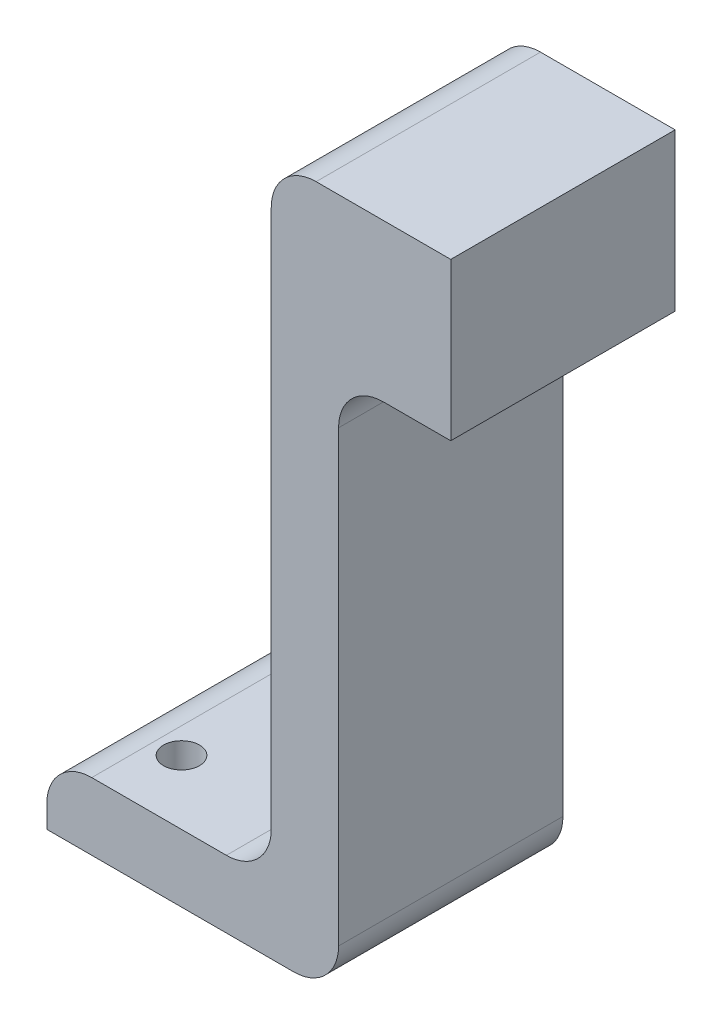
ISO-10303-21;
HEADER;
FILE_DESCRIPTION(('STEP AP214'),'2;1');
FILE_NAME('part.step','',(''),(''),'','','');
FILE_SCHEMA(('AUTOMOTIVE_DESIGN { 1 0 10303 214 1 1 1 1 }'));
ENDSEC;
DATA;
#1=APPLICATION_CONTEXT('core data for automotive mechanical design processes');
#2=APPLICATION_PROTOCOL_DEFINITION('international standard','automotive_design',2000,#1);
#3=PRODUCT_CONTEXT('',#1,'mechanical');
#4=PRODUCT('Part','Part','',(#3));
#5=PRODUCT_RELATED_PRODUCT_CATEGORY('part','',(#4));
#6=PRODUCT_DEFINITION_FORMATION('','',#4);
#7=PRODUCT_DEFINITION_CONTEXT('part definition',#1,'design');
#8=PRODUCT_DEFINITION('design','',#6,#7);
#9=PRODUCT_DEFINITION_SHAPE('','',#8);
#10=(LENGTH_UNIT() NAMED_UNIT(*) SI_UNIT(.MILLI.,.METRE.));
#11=(NAMED_UNIT(*) PLANE_ANGLE_UNIT() SI_UNIT($,.RADIAN.));
#12=(NAMED_UNIT(*) SI_UNIT($,.STERADIAN.) SOLID_ANGLE_UNIT());
#13=UNCERTAINTY_MEASURE_WITH_UNIT(LENGTH_MEASURE(1.E-05),#10,'distance_accuracy_value','');
#14=(GEOMETRIC_REPRESENTATION_CONTEXT(3) GLOBAL_UNCERTAINTY_ASSIGNED_CONTEXT((#13)) GLOBAL_UNIT_ASSIGNED_CONTEXT((#10,
#11,#12)) REPRESENTATION_CONTEXT('',''));
#15=CARTESIAN_POINT('',(0.,0.,0.));
#16=DIRECTION('',(0.,0.,1.));
#17=DIRECTION('',(1.,0.,0.));
#18=AXIS2_PLACEMENT_3D('',#15,#16,#17);
#19=CARTESIAN_POINT('',(0.,2.,-0.625));
#20=DIRECTION('',(0.,-1.,0.));
#21=DIRECTION('',(0.,0.,-1.));
#22=AXIS2_PLACEMENT_3D('',#19,#20,#21);
#23=PLANE('',#22);
#24=DIRECTION('',(1.,0.,0.));
#25=VECTOR('',#24,1.);
#26=CARTESIAN_POINT('',(0.,2.,-0.625));
#27=LINE('',#26,#25);
#28=CARTESIAN_POINT('',(0.0357694352722879,2.,-0.625));
#29=VERTEX_POINT('',#28);
#30=CARTESIAN_POINT('',(1.53576943527229,2.,-0.625));
#31=VERTEX_POINT('',#30);
#32=EDGE_CURVE('E223',#29,#31,#27,.T.);
#33=ORIENTED_EDGE('',*,*,#32,.F.);
#34=DIRECTION('',(0.,0.,1.));
#35=VECTOR('',#34,1.);
#36=CARTESIAN_POINT('',(0.0357694352722879,2.,-0.625));
#37=LINE('',#36,#35);
#38=CARTESIAN_POINT('',(0.0357694352722879,2.,1.875));
#39=VERTEX_POINT('',#38);
#40=EDGE_CURVE('E282',#29,#39,#37,.T.);
#41=ORIENTED_EDGE('',*,*,#40,.T.);
#42=DIRECTION('',(1.,0.,0.));
#43=VECTOR('',#42,1.);
#44=CARTESIAN_POINT('',(0.,2.,1.875));
#45=LINE('',#44,#43);
#46=CARTESIAN_POINT('',(1.53576943527229,2.,1.875));
#47=VERTEX_POINT('',#46);
#48=EDGE_CURVE('E213',#39,#47,#45,.T.);
#49=ORIENTED_EDGE('',*,*,#48,.T.);
#50=DIRECTION('',(0.,0.,1.));
#51=VECTOR('',#50,1.);
#52=CARTESIAN_POINT('',(1.53576943527229,2.,-0.625));
#53=LINE('',#52,#51);
#54=EDGE_CURVE('E207',#31,#47,#53,.T.);
#55=ORIENTED_EDGE('',*,*,#54,.F.);
#56=EDGE_LOOP('',(#33,#41,#49,#55));
#57=FACE_BOUND('',#56,.T.);
#58=ADVANCED_FACE('F89',(#57),#23,.F.);
#59=CARTESIAN_POINT('',(-0.464230564727712,0.,-0.625));
#60=DIRECTION('',(1.,0.,0.));
#61=DIRECTION('',(0.,1.,0.));
#62=AXIS2_PLACEMENT_3D('',#59,#60,#61);
#63=PLANE('',#62);
#64=DIRECTION('',(0.,1.,0.));
#65=VECTOR('',#64,1.);
#66=CARTESIAN_POINT('',(-0.464230564727712,0.,-0.625));
#67=LINE('',#66,#65);
#68=CARTESIAN_POINT('',(-0.464230564727711,-4.5,-0.625));
#69=VERTEX_POINT('',#68);
#70=CARTESIAN_POINT('',(-0.464230564727712,1.5,-0.625));
#71=VERTEX_POINT('',#70);
#72=EDGE_CURVE('E208',#69,#71,#67,.T.);
#73=ORIENTED_EDGE('',*,*,#72,.F.);
#74=DIRECTION('',(0.,0.,1.));
#75=VECTOR('',#74,1.);
#76=CARTESIAN_POINT('',(-0.464230564727711,-4.5,-0.625));
#77=LINE('',#76,#75);
#78=CARTESIAN_POINT('',(-0.464230564727711,-4.5,1.875));
#79=VERTEX_POINT('',#78);
#80=EDGE_CURVE('E277',#69,#79,#77,.T.);
#81=ORIENTED_EDGE('',*,*,#80,.T.);
#82=DIRECTION('',(0.,1.,0.));
#83=VECTOR('',#82,1.);
#84=CARTESIAN_POINT('',(-0.464230564727712,0.,1.875));
#85=LINE('',#84,#83);
#86=CARTESIAN_POINT('',(-0.464230564727712,1.5,1.875));
#87=VERTEX_POINT('',#86);
#88=EDGE_CURVE('E215',#79,#87,#85,.T.);
#89=ORIENTED_EDGE('',*,*,#88,.T.);
#90=DIRECTION('',(0.,0.,1.));
#91=VECTOR('',#90,1.);
#92=CARTESIAN_POINT('',(-0.464230564727712,1.5,-0.625));
#93=LINE('',#92,#91);
#94=EDGE_CURVE('E112',#87,#71,#93,.F.);
#95=ORIENTED_EDGE('',*,*,#94,.T.);
#96=EDGE_LOOP('',(#73,#81,#89,#95));
#97=FACE_BOUND('',#96,.T.);
#98=ADVANCED_FACE('F308',(#97),#63,.F.);
#99=CARTESIAN_POINT('',(1.53576943527229,0.,-0.625));
#100=DIRECTION('',(1.,0.,0.));
#101=DIRECTION('',(0.,0.,-1.));
#102=AXIS2_PLACEMENT_3D('',#99,#100,#101);
#103=PLANE('',#102);
#104=ORIENTED_EDGE('',*,*,#54,.T.);
#105=DIRECTION('',(0.,1.,0.));
#106=VECTOR('',#105,1.);
#107=CARTESIAN_POINT('',(1.53576943527229,0.,1.875));
#108=LINE('',#107,#106);
#109=CARTESIAN_POINT('',(1.53576943527229,0.25,1.875));
#110=VERTEX_POINT('',#109);
#111=EDGE_CURVE('E191',#110,#47,#108,.T.);
#112=ORIENTED_EDGE('',*,*,#111,.F.);
#113=DIRECTION('',(0.,0.,1.));
#114=VECTOR('',#113,1.);
#115=CARTESIAN_POINT('',(1.53576943527229,0.25,-0.625));
#116=LINE('',#115,#114);
#117=CARTESIAN_POINT('',(1.53576943527229,0.25,-0.625));
#118=VERTEX_POINT('',#117);
#119=EDGE_CURVE('E200',#118,#110,#116,.T.);
#120=ORIENTED_EDGE('',*,*,#119,.F.);
#121=DIRECTION('',(0.,1.,0.));
#122=VECTOR('',#121,1.);
#123=CARTESIAN_POINT('',(1.53576943527229,0.,-0.625));
#124=LINE('',#123,#122);
#125=EDGE_CURVE('E221',#118,#31,#124,.T.);
#126=ORIENTED_EDGE('',*,*,#125,.T.);
#127=EDGE_LOOP('',(#104,#112,#120,#126));
#128=FACE_BOUND('',#127,.T.);
#129=ADVANCED_FACE('F211',(#128),#103,.T.);
#130=CARTESIAN_POINT('',(0.,0.,-0.625));
#131=DIRECTION('',(0.,0.,1.));
#132=DIRECTION('',(1.,0.,0.));
#133=AXIS2_PLACEMENT_3D('',#130,#131,#132);
#134=PLANE('',#133);
#135=DIRECTION('',(0.,1.,0.));
#136=VECTOR('',#135,1.);
#137=CARTESIAN_POINT('',(-2.96423056472771,0.,-0.625));
#138=LINE('',#137,#136);
#139=CARTESIAN_POINT('',(-2.96423056472771,-5.75,-0.625));
#140=VERTEX_POINT('',#139);
#141=CARTESIAN_POINT('',(-2.96423056472771,-5.5,-0.625));
#142=VERTEX_POINT('',#141);
#143=EDGE_CURVE('E242',#140,#142,#138,.T.);
#144=ORIENTED_EDGE('',*,*,#143,.T.);
#145=CARTESIAN_POINT('',(-2.46423056472771,-5.5,-0.625));
#146=DIRECTION('',(0.,0.,1.));
#147=DIRECTION('',(1.,0.,0.));
#148=AXIS2_PLACEMENT_3D('',#145,#146,#147);
#149=CIRCLE('',#148,0.5);
#150=CARTESIAN_POINT('',(-2.46423056472771,-5.,-0.625));
#151=VERTEX_POINT('',#150);
#152=EDGE_CURVE('E267',#142,#151,#149,.F.);
#153=ORIENTED_EDGE('',*,*,#152,.T.);
#154=DIRECTION('',(-1.,0.,0.));
#155=VECTOR('',#154,1.);
#156=CARTESIAN_POINT('',(0.,-5.,-0.625));
#157=LINE('',#156,#155);
#158=CARTESIAN_POINT('',(-0.964230564727712,-5.,-0.625));
#159=VERTEX_POINT('',#158);
#160=EDGE_CURVE('E247',#159,#151,#157,.T.);
#161=ORIENTED_EDGE('',*,*,#160,.F.);
#162=CARTESIAN_POINT('',(-0.964230564727712,-4.5,-0.625));
#163=DIRECTION('',(0.,0.,1.));
#164=DIRECTION('',(1.,0.,0.));
#165=AXIS2_PLACEMENT_3D('',#162,#163,#164);
#166=CIRCLE('',#165,0.5);
#167=EDGE_CURVE('E287',#159,#69,#166,.T.);
#168=ORIENTED_EDGE('',*,*,#167,.T.);
#169=ORIENTED_EDGE('',*,*,#72,.T.);
#170=CARTESIAN_POINT('',(0.0357694352722879,1.5,-0.625));
#171=DIRECTION('',(0.,0.,1.));
#172=DIRECTION('',(1.,0.,0.));
#173=AXIS2_PLACEMENT_3D('',#170,#171,#172);
#174=CIRCLE('',#173,0.5);
#175=EDGE_CURVE('E104',#71,#29,#174,.F.);
#176=ORIENTED_EDGE('',*,*,#175,.T.);
#177=ORIENTED_EDGE('',*,*,#32,.T.);
#178=ORIENTED_EDGE('',*,*,#125,.F.);
#179=DIRECTION('',(1.,0.,0.));
#180=VECTOR('',#179,1.);
#181=CARTESIAN_POINT('',(0.,0.25,-0.625));
#182=LINE('',#181,#180);
#183=CARTESIAN_POINT('',(0.785769435272288,0.25,-0.625));
#184=VERTEX_POINT('',#183);
#185=EDGE_CURVE('E203',#184,#118,#182,.T.);
#186=ORIENTED_EDGE('',*,*,#185,.F.);
#187=CARTESIAN_POINT('',(0.785769435272288,-0.25,-0.625));
#188=DIRECTION('',(0.,0.,1.));
#189=DIRECTION('',(1.,0.,0.));
#190=AXIS2_PLACEMENT_3D('',#187,#188,#189);
#191=CIRCLE('',#190,0.5);
#192=CARTESIAN_POINT('',(0.285769435272288,-0.25,-0.625));
#193=VERTEX_POINT('',#192);
#194=EDGE_CURVE('E97',#184,#193,#191,.T.);
#195=ORIENTED_EDGE('',*,*,#194,.T.);
#196=DIRECTION('',(0.,-1.,0.));
#197=VECTOR('',#196,1.);
#198=CARTESIAN_POINT('',(0.285769435272288,0.25,-0.625));
#199=LINE('',#198,#197);
#200=CARTESIAN_POINT('',(0.285769435272291,-5.25,-0.625));
#201=VERTEX_POINT('',#200);
#202=EDGE_CURVE('E228',#193,#201,#199,.T.);
#203=ORIENTED_EDGE('',*,*,#202,.T.);
#204=CARTESIAN_POINT('',(-0.214230564727709,-5.25,-0.625));
#205=DIRECTION('',(0.,0.,1.));
#206=DIRECTION('',(1.,0.,0.));
#207=AXIS2_PLACEMENT_3D('',#204,#205,#206);
#208=CIRCLE('',#207,0.5);
#209=CARTESIAN_POINT('',(-0.214230564727709,-5.75,-0.625));
#210=VERTEX_POINT('',#209);
#211=EDGE_CURVE('E265',#201,#210,#208,.F.);
#212=ORIENTED_EDGE('',*,*,#211,.T.);
#213=DIRECTION('',(-1.,0.,0.));
#214=VECTOR('',#213,1.);
#215=CARTESIAN_POINT('',(0.,-5.75,-0.625));
#216=LINE('',#215,#214);
#217=EDGE_CURVE('E245',#210,#140,#216,.T.);
#218=ORIENTED_EDGE('',*,*,#217,.T.);
#219=EDGE_LOOP('',(#144,#153,#161,#168,#169,#176,#177,#178,#186,#195,#203,#212,#218));
#220=FACE_BOUND('',#219,.T.);
#221=ADVANCED_FACE('F289',(#220),#134,.F.);
#222=CARTESIAN_POINT('',(0.,0.,1.875));
#223=DIRECTION('',(0.,0.,1.));
#224=DIRECTION('',(1.,0.,0.));
#225=AXIS2_PLACEMENT_3D('',#222,#223,#224);
#226=PLANE('',#225);
#227=DIRECTION('',(-1.,0.,0.));
#228=VECTOR('',#227,1.);
#229=CARTESIAN_POINT('',(0.,-5.,1.875));
#230=LINE('',#229,#228);
#231=CARTESIAN_POINT('',(-0.964230564727712,-5.,1.875));
#232=VERTEX_POINT('',#231);
#233=CARTESIAN_POINT('',(-2.46423056472771,-5.,1.875));
#234=VERTEX_POINT('',#233);
#235=EDGE_CURVE('E240',#232,#234,#230,.T.);
#236=ORIENTED_EDGE('',*,*,#235,.T.);
#237=CARTESIAN_POINT('',(-2.46423056472771,-5.5,1.875));
#238=DIRECTION('',(0.,0.,1.));
#239=DIRECTION('',(1.,0.,0.));
#240=AXIS2_PLACEMENT_3D('',#237,#238,#239);
#241=CIRCLE('',#240,0.5);
#242=CARTESIAN_POINT('',(-2.96423056472771,-5.5,1.875));
#243=VERTEX_POINT('',#242);
#244=EDGE_CURVE('E260',#234,#243,#241,.T.);
#245=ORIENTED_EDGE('',*,*,#244,.T.);
#246=DIRECTION('',(0.,1.,0.));
#247=VECTOR('',#246,1.);
#248=CARTESIAN_POINT('',(-2.96423056472771,0.,1.875));
#249=LINE('',#248,#247);
#250=CARTESIAN_POINT('',(-2.96423056472771,-5.75,1.875));
#251=VERTEX_POINT('',#250);
#252=EDGE_CURVE('E235',#251,#243,#249,.T.);
#253=ORIENTED_EDGE('',*,*,#252,.F.);
#254=DIRECTION('',(-1.,0.,0.));
#255=VECTOR('',#254,1.);
#256=CARTESIAN_POINT('',(0.,-5.75,1.875));
#257=LINE('',#256,#255);
#258=CARTESIAN_POINT('',(-0.214230564727709,-5.75,1.875));
#259=VERTEX_POINT('',#258);
#260=EDGE_CURVE('E238',#259,#251,#257,.T.);
#261=ORIENTED_EDGE('',*,*,#260,.F.);
#262=CARTESIAN_POINT('',(-0.214230564727709,-5.25,1.875));
#263=DIRECTION('',(0.,0.,1.));
#264=DIRECTION('',(1.,0.,0.));
#265=AXIS2_PLACEMENT_3D('',#262,#263,#264);
#266=CIRCLE('',#265,0.5);
#267=CARTESIAN_POINT('',(0.285769435272291,-5.25,1.875));
#268=VERTEX_POINT('',#267);
#269=EDGE_CURVE('E258',#259,#268,#266,.T.);
#270=ORIENTED_EDGE('',*,*,#269,.T.);
#271=DIRECTION('',(0.,-1.,0.));
#272=VECTOR('',#271,1.);
#273=CARTESIAN_POINT('',(0.285769435272288,0.25,1.875));
#274=LINE('',#273,#272);
#275=CARTESIAN_POINT('',(0.285769435272288,-0.25,1.875));
#276=VERTEX_POINT('',#275);
#277=EDGE_CURVE('E231',#276,#268,#274,.T.);
#278=ORIENTED_EDGE('',*,*,#277,.F.);
#279=CARTESIAN_POINT('',(0.785769435272288,-0.25,1.875));
#280=DIRECTION('',(0.,0.,1.));
#281=DIRECTION('',(1.,0.,0.));
#282=AXIS2_PLACEMENT_3D('',#279,#280,#281);
#283=CIRCLE('',#282,0.5);
#284=CARTESIAN_POINT('',(0.785769435272288,0.25,1.875));
#285=VERTEX_POINT('',#284);
#286=EDGE_CURVE('E12',#276,#285,#283,.F.);
#287=ORIENTED_EDGE('',*,*,#286,.T.);
#288=DIRECTION('',(1.,0.,0.));
#289=VECTOR('',#288,1.);
#290=CARTESIAN_POINT('',(0.,0.25,1.875));
#291=LINE('',#290,#289);
#292=EDGE_CURVE('E185',#285,#110,#291,.T.);
#293=ORIENTED_EDGE('',*,*,#292,.T.);
#294=ORIENTED_EDGE('',*,*,#111,.T.);
#295=ORIENTED_EDGE('',*,*,#48,.F.);
#296=CARTESIAN_POINT('',(0.0357694352722879,1.5,1.875));
#297=DIRECTION('',(0.,0.,1.));
#298=DIRECTION('',(1.,0.,0.));
#299=AXIS2_PLACEMENT_3D('',#296,#297,#298);
#300=CIRCLE('',#299,0.5);
#301=EDGE_CURVE('E256',#39,#87,#300,.T.);
#302=ORIENTED_EDGE('',*,*,#301,.T.);
#303=ORIENTED_EDGE('',*,*,#88,.F.);
#304=CARTESIAN_POINT('',(-0.964230564727712,-4.5,1.875));
#305=DIRECTION('',(0.,0.,1.));
#306=DIRECTION('',(1.,0.,0.));
#307=AXIS2_PLACEMENT_3D('',#304,#305,#306);
#308=CIRCLE('',#307,0.5);
#309=EDGE_CURVE('E285',#79,#232,#308,.F.);
#310=ORIENTED_EDGE('',*,*,#309,.T.);
#311=EDGE_LOOP('',(#236,#245,#253,#261,#270,#278,#287,#293,#294,#295,#302,#303,#310));
#312=FACE_BOUND('',#311,.T.);
#313=ADVANCED_FACE('F188',(#312),#226,.T.);
#314=CARTESIAN_POINT('',(0.,0.25,-0.625));
#315=DIRECTION('',(0.,-1.,0.));
#316=DIRECTION('',(0.,0.,-1.));
#317=AXIS2_PLACEMENT_3D('',#314,#315,#316);
#318=PLANE('',#317);
#319=ORIENTED_EDGE('',*,*,#292,.F.);
#320=DIRECTION('',(0.,0.,-1.));
#321=VECTOR('',#320,1.);
#322=CARTESIAN_POINT('',(0.785769435272288,0.25,-0.625));
#323=LINE('',#322,#321);
#324=EDGE_CURVE('E280',#285,#184,#323,.T.);
#325=ORIENTED_EDGE('',*,*,#324,.T.);
#326=ORIENTED_EDGE('',*,*,#185,.T.);
#327=ORIENTED_EDGE('',*,*,#119,.T.);
#328=EDGE_LOOP('',(#319,#325,#326,#327));
#329=FACE_BOUND('',#328,.T.);
#330=ADVANCED_FACE('F201',(#329),#318,.T.);
#331=CARTESIAN_POINT('',(0.,-5.,-0.625));
#332=DIRECTION('',(0.,1.,0.));
#333=DIRECTION('',(0.,0.,1.));
#334=AXIS2_PLACEMENT_3D('',#331,#332,#333);
#335=PLANE('',#334);
#336=CARTESIAN_POINT('',(-1.71423056472771,-5.,0.));
#337=DIRECTION('',(0.,1.,0.));
#338=DIRECTION('',(0.,0.,1.));
#339=AXIS2_PLACEMENT_3D('',#336,#337,#338);
#340=CIRCLE('',#339,0.2);
#341=CARTESIAN_POINT('',(-1.71423056472771,-5.,0.2));
#342=VERTEX_POINT('',#341);
#343=EDGE_CURVE('E483',#342,#342,#340,.T.);
#344=ORIENTED_EDGE('',*,*,#343,.F.);
#345=EDGE_LOOP('',(#344));
#346=FACE_BOUND('',#345,.T.);
#347=CARTESIAN_POINT('',(-2.17846891017034,-5.,1.16059586360657));
#348=DIRECTION('',(0.,1.,0.));
#349=DIRECTION('',(0.,0.,1.));
#350=AXIS2_PLACEMENT_3D('',#347,#348,#349);
#351=CIRCLE('',#350,0.2);
#352=CARTESIAN_POINT('',(-2.17846891017034,-5.,1.36059586360657));
#353=VERTEX_POINT('',#352);
#354=EDGE_CURVE('E485',#353,#353,#351,.T.);
#355=ORIENTED_EDGE('',*,*,#354,.F.);
#356=EDGE_LOOP('',(#355));
#357=FACE_BOUND('',#356,.T.);
#358=ORIENTED_EDGE('',*,*,#160,.T.);
#359=DIRECTION('',(0.,0.,1.));
#360=VECTOR('',#359,1.);
#361=CARTESIAN_POINT('',(-2.46423056472771,-5.,1.875));
#362=LINE('',#361,#360);
#363=EDGE_CURVE('E253',#151,#234,#362,.T.);
#364=ORIENTED_EDGE('',*,*,#363,.T.);
#365=ORIENTED_EDGE('',*,*,#235,.F.);
#366=DIRECTION('',(0.,0.,1.));
#367=VECTOR('',#366,1.);
#368=CARTESIAN_POINT('',(-0.964230564727712,-5.,-0.625));
#369=LINE('',#368,#367);
#370=EDGE_CURVE('E226',#232,#159,#369,.F.);
#371=ORIENTED_EDGE('',*,*,#370,.T.);
#372=EDGE_LOOP('',(#358,#364,#365,#371));
#373=FACE_BOUND('',#372,.T.);
#374=ADVANCED_FACE('F321',(#346,#357,#373),#335,.T.);
#375=CARTESIAN_POINT('',(-2.96423056472771,0.,-0.625));
#376=DIRECTION('',(1.,0.,0.));
#377=DIRECTION('',(0.,0.,-1.));
#378=AXIS2_PLACEMENT_3D('',#375,#376,#377);
#379=PLANE('',#378);
#380=ORIENTED_EDGE('',*,*,#252,.T.);
#381=DIRECTION('',(0.,0.,1.));
#382=VECTOR('',#381,1.);
#383=CARTESIAN_POINT('',(-2.96423056472771,-5.5,-0.625));
#384=LINE('',#383,#382);
#385=EDGE_CURVE('E262',#243,#142,#384,.F.);
#386=ORIENTED_EDGE('',*,*,#385,.T.);
#387=ORIENTED_EDGE('',*,*,#143,.F.);
#388=DIRECTION('',(0.,0.,1.));
#389=VECTOR('',#388,1.);
#390=CARTESIAN_POINT('',(-2.96423056472771,-5.75,-0.625));
#391=LINE('',#390,#389);
#392=EDGE_CURVE('E197',#140,#251,#391,.T.);
#393=ORIENTED_EDGE('',*,*,#392,.T.);
#394=EDGE_LOOP('',(#380,#386,#387,#393));
#395=FACE_BOUND('',#394,.T.);
#396=ADVANCED_FACE('F326',(#395),#379,.F.);
#397=CARTESIAN_POINT('',(0.,-5.75,-0.625));
#398=DIRECTION('',(0.,1.,0.));
#399=DIRECTION('',(0.,0.,1.));
#400=AXIS2_PLACEMENT_3D('',#397,#398,#399);
#401=PLANE('',#400);
#402=CARTESIAN_POINT('',(-1.71423056472771,-5.75,0.));
#403=DIRECTION('',(0.,1.,0.));
#404=DIRECTION('',(0.,0.,1.));
#405=AXIS2_PLACEMENT_3D('',#402,#403,#404);
#406=CIRCLE('',#405,0.2);
#407=CARTESIAN_POINT('',(-1.71423056472771,-5.75,0.2));
#408=VERTEX_POINT('',#407);
#409=EDGE_CURVE('E480',#408,#408,#406,.T.);
#410=ORIENTED_EDGE('',*,*,#409,.T.);
#411=EDGE_LOOP('',(#410));
#412=FACE_BOUND('',#411,.T.);
#413=CARTESIAN_POINT('',(-2.17846891017034,-5.75,1.16059586360657));
#414=DIRECTION('',(0.,1.,0.));
#415=DIRECTION('',(0.,0.,1.));
#416=AXIS2_PLACEMENT_3D('',#413,#414,#415);
#417=CIRCLE('',#416,0.2);
#418=CARTESIAN_POINT('',(-2.17846891017034,-5.75,1.36059586360657));
#419=VERTEX_POINT('',#418);
#420=EDGE_CURVE('E232',#419,#419,#417,.T.);
#421=ORIENTED_EDGE('',*,*,#420,.T.);
#422=EDGE_LOOP('',(#421));
#423=FACE_BOUND('',#422,.T.);
#424=ORIENTED_EDGE('',*,*,#217,.F.);
#425=DIRECTION('',(0.,0.,-1.));
#426=VECTOR('',#425,1.);
#427=CARTESIAN_POINT('',(-0.214230564727709,-5.75,1.875));
#428=LINE('',#427,#426);
#429=EDGE_CURVE('E274',#210,#259,#428,.F.);
#430=ORIENTED_EDGE('',*,*,#429,.T.);
#431=ORIENTED_EDGE('',*,*,#260,.T.);
#432=ORIENTED_EDGE('',*,*,#392,.F.);
#433=EDGE_LOOP('',(#424,#430,#431,#432));
#434=FACE_BOUND('',#433,.T.);
#435=ADVANCED_FACE('F325',(#412,#423,#434),#401,.F.);
#436=CARTESIAN_POINT('',(0.285769435272288,0.25,1.875));
#437=DIRECTION('',(1.,0.,0.));
#438=DIRECTION('',(0.,1.,0.));
#439=AXIS2_PLACEMENT_3D('',#436,#437,#438);
#440=PLANE('',#439);
#441=ORIENTED_EDGE('',*,*,#277,.T.);
#442=DIRECTION('',(0.,0.,-1.));
#443=VECTOR('',#442,1.);
#444=CARTESIAN_POINT('',(0.285769435272291,-5.25,-0.625));
#445=LINE('',#444,#443);
#446=EDGE_CURVE('E271',#268,#201,#445,.T.);
#447=ORIENTED_EDGE('',*,*,#446,.T.);
#448=ORIENTED_EDGE('',*,*,#202,.F.);
#449=DIRECTION('',(0.,0.,-1.));
#450=VECTOR('',#449,1.);
#451=CARTESIAN_POINT('',(0.285769435272288,-0.25,1.875));
#452=LINE('',#451,#450);
#453=EDGE_CURVE('E269',#193,#276,#452,.F.);
#454=ORIENTED_EDGE('',*,*,#453,.T.);
#455=EDGE_LOOP('',(#441,#447,#448,#454));
#456=FACE_BOUND('',#455,.T.);
#457=ADVANCED_FACE('F293',(#456),#440,.T.);
#458=CARTESIAN_POINT('',(-2.46423056472771,-5.5,-0.625));
#459=DIRECTION('',(0.,0.,-1.));
#460=DIRECTION('',(-1.,0.,0.));
#461=AXIS2_PLACEMENT_3D('',#458,#459,#460);
#462=CYLINDRICAL_SURFACE('',#461,0.5);
#463=ORIENTED_EDGE('',*,*,#152,.F.);
#464=ORIENTED_EDGE('',*,*,#385,.F.);
#465=ORIENTED_EDGE('',*,*,#244,.F.);
#466=ORIENTED_EDGE('',*,*,#363,.F.);
#467=EDGE_LOOP('',(#463,#464,#465,#466));
#468=FACE_BOUND('',#467,.T.);
#469=ADVANCED_FACE('F324',(#468),#462,.T.);
#470=CARTESIAN_POINT('',(-0.214230564727709,-5.25,1.875));
#471=DIRECTION('',(0.,0.,1.));
#472=DIRECTION('',(1.,0.,0.));
#473=AXIS2_PLACEMENT_3D('',#470,#471,#472);
#474=CYLINDRICAL_SURFACE('',#473,0.5);
#475=ORIENTED_EDGE('',*,*,#269,.F.);
#476=ORIENTED_EDGE('',*,*,#429,.F.);
#477=ORIENTED_EDGE('',*,*,#211,.F.);
#478=ORIENTED_EDGE('',*,*,#446,.F.);
#479=EDGE_LOOP('',(#475,#476,#477,#478));
#480=FACE_BOUND('',#479,.T.);
#481=ADVANCED_FACE('F304',(#480),#474,.T.);
#482=CARTESIAN_POINT('',(-0.964230564727712,-4.5,-0.625));
#483=DIRECTION('',(0.,0.,1.));
#484=DIRECTION('',(1.,0.,0.));
#485=AXIS2_PLACEMENT_3D('',#482,#483,#484);
#486=CYLINDRICAL_SURFACE('',#485,0.5);
#487=ORIENTED_EDGE('',*,*,#167,.F.);
#488=ORIENTED_EDGE('',*,*,#370,.F.);
#489=ORIENTED_EDGE('',*,*,#309,.F.);
#490=ORIENTED_EDGE('',*,*,#80,.F.);
#491=EDGE_LOOP('',(#487,#488,#489,#490));
#492=FACE_BOUND('',#491,.T.);
#493=ADVANCED_FACE('F297',(#492),#486,.F.);
#494=CARTESIAN_POINT('',(0.785769435272288,-0.25,-0.625));
#495=DIRECTION('',(0.,0.,1.));
#496=DIRECTION('',(1.,0.,0.));
#497=AXIS2_PLACEMENT_3D('',#494,#495,#496);
#498=CYLINDRICAL_SURFACE('',#497,0.5);
#499=ORIENTED_EDGE('',*,*,#286,.F.);
#500=ORIENTED_EDGE('',*,*,#453,.F.);
#501=ORIENTED_EDGE('',*,*,#194,.F.);
#502=ORIENTED_EDGE('',*,*,#324,.F.);
#503=EDGE_LOOP('',(#499,#500,#501,#502));
#504=FACE_BOUND('',#503,.T.);
#505=ADVANCED_FACE('F295',(#504),#498,.F.);
#506=CARTESIAN_POINT('',(0.0357694352722879,1.5,-0.625));
#507=DIRECTION('',(0.,0.,1.));
#508=DIRECTION('',(1.,0.,0.));
#509=AXIS2_PLACEMENT_3D('',#506,#507,#508);
#510=CYLINDRICAL_SURFACE('',#509,0.5);
#511=ORIENTED_EDGE('',*,*,#175,.F.);
#512=ORIENTED_EDGE('',*,*,#94,.F.);
#513=ORIENTED_EDGE('',*,*,#301,.F.);
#514=ORIENTED_EDGE('',*,*,#40,.F.);
#515=EDGE_LOOP('',(#511,#512,#513,#514));
#516=FACE_BOUND('',#515,.T.);
#517=ADVANCED_FACE('F91',(#516),#510,.T.);
#518=CARTESIAN_POINT('',(-2.17846891017034,-5.,1.16059586360657));
#519=DIRECTION('',(0.,1.,0.));
#520=DIRECTION('',(0.,0.,1.));
#521=AXIS2_PLACEMENT_3D('',#518,#519,#520);
#522=CYLINDRICAL_SURFACE('',#521,0.2);
#523=ORIENTED_EDGE('',*,*,#420,.F.);
#524=EDGE_LOOP('',(#523));
#525=FACE_BOUND('',#524,.T.);
#526=ORIENTED_EDGE('',*,*,#354,.T.);
#527=EDGE_LOOP('',(#526));
#528=FACE_BOUND('',#527,.T.);
#529=ADVANCED_FACE('F302',(#525,#528),#522,.F.);
#530=CARTESIAN_POINT('',(-1.71423056472771,-5.,0.));
#531=DIRECTION('',(0.,1.,0.));
#532=DIRECTION('',(0.,0.,1.));
#533=AXIS2_PLACEMENT_3D('',#530,#531,#532);
#534=CYLINDRICAL_SURFACE('',#533,0.2);
#535=ORIENTED_EDGE('',*,*,#409,.F.);
#536=EDGE_LOOP('',(#535));
#537=FACE_BOUND('',#536,.T.);
#538=ORIENTED_EDGE('',*,*,#343,.T.);
#539=EDGE_LOOP('',(#538));
#540=FACE_BOUND('',#539,.T.);
#541=ADVANCED_FACE('F403',(#537,#540),#534,.F.);
#542=CLOSED_SHELL('',(#58,#98,#129,#221,#313,#330,#374,#396,#435,#457,#469,#481,#493,#505,#517,
#529,#541));
#543=MANIFOLD_SOLID_BREP('B2',#542);
#544=ADVANCED_BREP_SHAPE_REPRESENTATION('',(#18,#543),#14);
#545=SHAPE_DEFINITION_REPRESENTATION(#9,#544);
ENDSEC;
END-ISO-10303-21;
